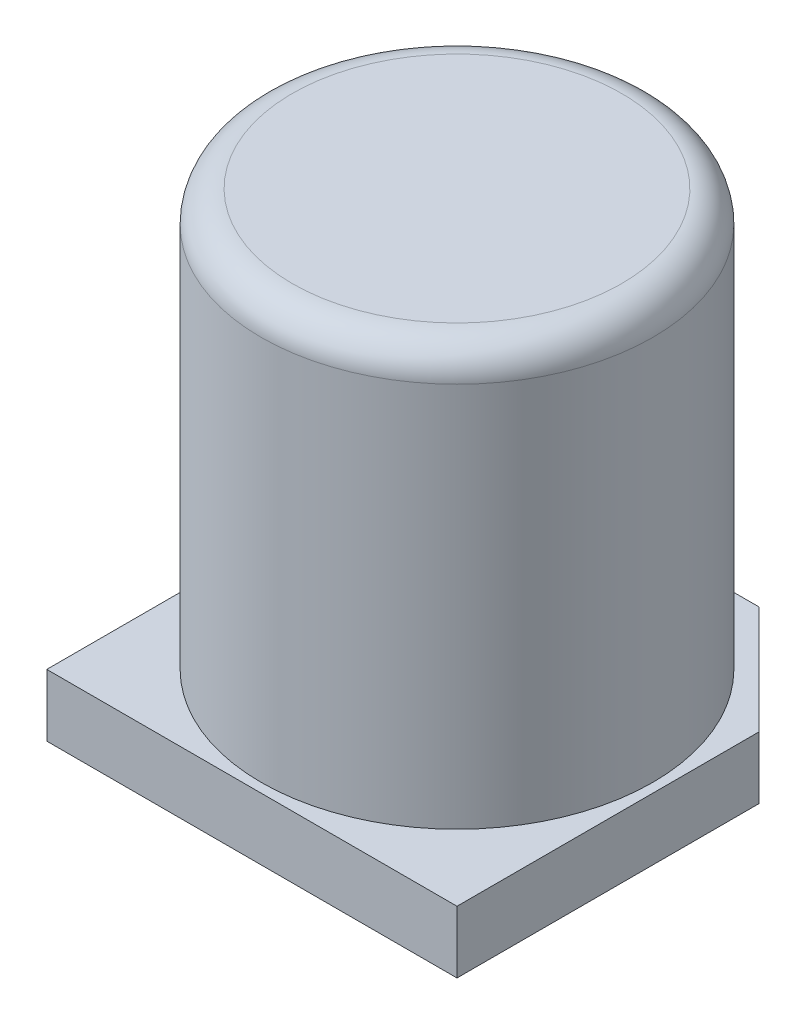
ISO-10303-21;
HEADER;
FILE_DESCRIPTION(('STEP AP214'),'2;1');
FILE_NAME('part.step','',(''),(''),'','','');
FILE_SCHEMA(('AUTOMOTIVE_DESIGN { 1 0 10303 214 1 1 1 1 }'));
ENDSEC;
DATA;
#1=APPLICATION_CONTEXT('core data for automotive mechanical design processes');
#2=APPLICATION_PROTOCOL_DEFINITION('international standard','automotive_design',2000,#1);
#3=PRODUCT_CONTEXT('',#1,'mechanical');
#4=PRODUCT('Part','Part','',(#3));
#5=PRODUCT_RELATED_PRODUCT_CATEGORY('part','',(#4));
#6=PRODUCT_DEFINITION_FORMATION('','',#4);
#7=PRODUCT_DEFINITION_CONTEXT('part definition',#1,'design');
#8=PRODUCT_DEFINITION('design','',#6,#7);
#9=PRODUCT_DEFINITION_SHAPE('','',#8);
#10=(LENGTH_UNIT() NAMED_UNIT(*) SI_UNIT(.MILLI.,.METRE.));
#11=(NAMED_UNIT(*) PLANE_ANGLE_UNIT() SI_UNIT($,.RADIAN.));
#12=(NAMED_UNIT(*) SI_UNIT($,.STERADIAN.) SOLID_ANGLE_UNIT());
#13=UNCERTAINTY_MEASURE_WITH_UNIT(LENGTH_MEASURE(1.E-05),#10,'distance_accuracy_value','');
#14=(GEOMETRIC_REPRESENTATION_CONTEXT(3) GLOBAL_UNCERTAINTY_ASSIGNED_CONTEXT((#13)) GLOBAL_UNIT_ASSIGNED_CONTEXT((#10,
#11,#12)) REPRESENTATION_CONTEXT('',''));
#15=CARTESIAN_POINT('',(0.,0.,0.));
#16=DIRECTION('',(0.,0.,1.));
#17=DIRECTION('',(1.,0.,0.));
#18=AXIS2_PLACEMENT_3D('',#15,#16,#17);
#19=CARTESIAN_POINT('',(3.3,1.,3.3));
#20=DIRECTION('',(0.,0.,1.));
#21=DIRECTION('',(1.,0.,0.));
#22=AXIS2_PLACEMENT_3D('',#19,#20,#21);
#23=PLANE('',#22);
#24=DIRECTION('',(-1.,0.,0.));
#25=VECTOR('',#24,1.);
#26=CARTESIAN_POINT('',(3.3,0.,3.3));
#27=LINE('',#26,#25);
#28=CARTESIAN_POINT('',(3.3,0.,3.3));
#29=VERTEX_POINT('',#28);
#30=CARTESIAN_POINT('',(-3.3,0.,3.3));
#31=VERTEX_POINT('',#30);
#32=EDGE_CURVE('E118',#29,#31,#27,.T.);
#33=ORIENTED_EDGE('',*,*,#32,.F.);
#34=DIRECTION('',(0.,-1.,0.));
#35=VECTOR('',#34,1.);
#36=CARTESIAN_POINT('',(3.3,1.,3.3));
#37=LINE('',#36,#35);
#38=CARTESIAN_POINT('',(3.3,1.,3.3));
#39=VERTEX_POINT('',#38);
#40=EDGE_CURVE('E98',#39,#29,#37,.T.);
#41=ORIENTED_EDGE('',*,*,#40,.F.);
#42=DIRECTION('',(-1.,0.,0.));
#43=VECTOR('',#42,1.);
#44=CARTESIAN_POINT('',(3.3,1.,3.3));
#45=LINE('',#44,#43);
#46=CARTESIAN_POINT('',(-3.3,1.,3.3));
#47=VERTEX_POINT('',#46);
#48=EDGE_CURVE('E103',#39,#47,#45,.T.);
#49=ORIENTED_EDGE('',*,*,#48,.T.);
#50=DIRECTION('',(0.,-1.,0.));
#51=VECTOR('',#50,1.);
#52=CARTESIAN_POINT('',(-3.3,1.,3.3));
#53=LINE('',#52,#51);
#54=EDGE_CURVE('E87',#47,#31,#53,.T.);
#55=ORIENTED_EDGE('',*,*,#54,.T.);
#56=EDGE_LOOP('',(#33,#41,#49,#55));
#57=FACE_BOUND('',#56,.T.);
#58=ADVANCED_FACE('F32',(#57),#23,.T.);
#59=CARTESIAN_POINT('',(3.3,1.,-3.3));
#60=DIRECTION('',(1.,0.,0.));
#61=DIRECTION('',(0.,0.,-1.));
#62=AXIS2_PLACEMENT_3D('',#59,#60,#61);
#63=PLANE('',#62);
#64=DIRECTION('',(0.,0.,1.));
#65=VECTOR('',#64,1.);
#66=CARTESIAN_POINT('',(3.3,0.,-3.3));
#67=LINE('',#66,#65);
#68=CARTESIAN_POINT('',(3.3,0.,-1.56254826892699));
#69=VERTEX_POINT('',#68);
#70=EDGE_CURVE('E108',#69,#29,#67,.T.);
#71=ORIENTED_EDGE('',*,*,#70,.F.);
#72=DIRECTION('',(0.,1.,0.));
#73=VECTOR('',#72,1.);
#74=CARTESIAN_POINT('',(3.3,1.,-1.56254826892699));
#75=LINE('',#74,#73);
#76=CARTESIAN_POINT('',(3.3,1.,-1.56254826892699));
#77=VERTEX_POINT('',#76);
#78=EDGE_CURVE('E55',#69,#77,#75,.T.);
#79=ORIENTED_EDGE('',*,*,#78,.T.);
#80=DIRECTION('',(0.,0.,1.));
#81=VECTOR('',#80,1.);
#82=CARTESIAN_POINT('',(3.3,1.,-3.3));
#83=LINE('',#82,#81);
#84=EDGE_CURVE('E99',#77,#39,#83,.T.);
#85=ORIENTED_EDGE('',*,*,#84,.T.);
#86=ORIENTED_EDGE('',*,*,#40,.T.);
#87=EDGE_LOOP('',(#71,#79,#85,#86));
#88=FACE_BOUND('',#87,.T.);
#89=ADVANCED_FACE('F154',(#88),#63,.T.);
#90=CARTESIAN_POINT('',(-3.3,1.,-3.3));
#91=DIRECTION('',(0.,0.,-1.));
#92=DIRECTION('',(-1.,0.,0.));
#93=AXIS2_PLACEMENT_3D('',#90,#91,#92);
#94=PLANE('',#93);
#95=DIRECTION('',(1.,0.,0.));
#96=VECTOR('',#95,1.);
#97=CARTESIAN_POINT('',(-3.3,1.,-3.3));
#98=LINE('',#97,#96);
#99=CARTESIAN_POINT('',(-1.56254826892699,1.,-3.3));
#100=VERTEX_POINT('',#99);
#101=CARTESIAN_POINT('',(1.56254826892701,1.,-3.3));
#102=VERTEX_POINT('',#101);
#103=EDGE_CURVE('E104',#100,#102,#98,.T.);
#104=ORIENTED_EDGE('',*,*,#103,.T.);
#105=DIRECTION('',(0.,-1.,0.));
#106=VECTOR('',#105,1.);
#107=CARTESIAN_POINT('',(1.56254826892701,1.,-3.3));
#108=LINE('',#107,#106);
#109=CARTESIAN_POINT('',(1.56254826892701,0.,-3.3));
#110=VERTEX_POINT('',#109);
#111=EDGE_CURVE('E126',#102,#110,#108,.T.);
#112=ORIENTED_EDGE('',*,*,#111,.T.);
#113=DIRECTION('',(1.,0.,0.));
#114=VECTOR('',#113,1.);
#115=CARTESIAN_POINT('',(-3.3,0.,-3.3));
#116=LINE('',#115,#114);
#117=CARTESIAN_POINT('',(-1.56254826892699,0.,-3.3));
#118=VERTEX_POINT('',#117);
#119=EDGE_CURVE('E110',#118,#110,#116,.T.);
#120=ORIENTED_EDGE('',*,*,#119,.F.);
#121=DIRECTION('',(0.,1.,0.));
#122=VECTOR('',#121,1.);
#123=CARTESIAN_POINT('',(-1.56254826892699,1.,-3.3));
#124=LINE('',#123,#122);
#125=EDGE_CURVE('E123',#118,#100,#124,.T.);
#126=ORIENTED_EDGE('',*,*,#125,.T.);
#127=EDGE_LOOP('',(#104,#112,#120,#126));
#128=FACE_BOUND('',#127,.T.);
#129=ADVANCED_FACE('F159',(#128),#94,.T.);
#130=CARTESIAN_POINT('',(-3.3,1.,3.3));
#131=DIRECTION('',(-1.,0.,0.));
#132=DIRECTION('',(0.,0.,1.));
#133=AXIS2_PLACEMENT_3D('',#130,#131,#132);
#134=PLANE('',#133);
#135=DIRECTION('',(0.,0.,-1.));
#136=VECTOR('',#135,1.);
#137=CARTESIAN_POINT('',(-3.3,1.,3.3));
#138=LINE('',#137,#136);
#139=CARTESIAN_POINT('',(-3.3,1.,-1.562548268927));
#140=VERTEX_POINT('',#139);
#141=EDGE_CURVE('E90',#47,#140,#138,.T.);
#142=ORIENTED_EDGE('',*,*,#141,.T.);
#143=DIRECTION('',(0.,-1.,0.));
#144=VECTOR('',#143,1.);
#145=CARTESIAN_POINT('',(-3.3,1.,-1.56254826892701));
#146=LINE('',#145,#144);
#147=CARTESIAN_POINT('',(-3.3,0.,-1.56254826892701));
#148=VERTEX_POINT('',#147);
#149=EDGE_CURVE('E137',#140,#148,#146,.T.);
#150=ORIENTED_EDGE('',*,*,#149,.T.);
#151=DIRECTION('',(0.,0.,-1.));
#152=VECTOR('',#151,1.);
#153=CARTESIAN_POINT('',(-3.3,0.,3.3));
#154=LINE('',#153,#152);
#155=EDGE_CURVE('E93',#31,#148,#154,.T.);
#156=ORIENTED_EDGE('',*,*,#155,.F.);
#157=ORIENTED_EDGE('',*,*,#54,.F.);
#158=EDGE_LOOP('',(#142,#150,#156,#157));
#159=FACE_BOUND('',#158,.T.);
#160=ADVANCED_FACE('F88',(#159),#134,.T.);
#161=CARTESIAN_POINT('',(0.,1.,0.));
#162=DIRECTION('',(0.,-1.,0.));
#163=DIRECTION('',(0.,0.,-1.));
#164=AXIS2_PLACEMENT_3D('',#161,#162,#163);
#165=PLANE('',#164);
#166=CARTESIAN_POINT('',(0.,1.,0.));
#167=DIRECTION('',(0.,-1.,0.));
#168=DIRECTION('',(0.,0.,-1.));
#169=AXIS2_PLACEMENT_3D('',#166,#167,#168);
#170=CIRCLE('',#169,3.15);
#171=CARTESIAN_POINT('',(0.,1.,-3.15));
#172=VERTEX_POINT('',#171);
#173=EDGE_CURVE('E113',#172,#172,#170,.T.);
#174=ORIENTED_EDGE('',*,*,#173,.T.);
#175=EDGE_LOOP('',(#174));
#176=FACE_BOUND('',#175,.T.);
#177=ORIENTED_EDGE('',*,*,#84,.F.);
#178=DIRECTION('',(0.707106781186545,0.,0.70710678118655));
#179=VECTOR('',#178,1.);
#180=CARTESIAN_POINT('',(1.56254826892701,1.,-3.3));
#181=LINE('',#180,#179);
#182=EDGE_CURVE('E135',#77,#102,#181,.F.);
#183=ORIENTED_EDGE('',*,*,#182,.T.);
#184=ORIENTED_EDGE('',*,*,#103,.F.);
#185=DIRECTION('',(0.70710678118655,0.,-0.707106781186545));
#186=VECTOR('',#185,1.);
#187=CARTESIAN_POINT('',(-3.3,1.,-1.56254826892701));
#188=LINE('',#187,#186);
#189=EDGE_CURVE('E47',#100,#140,#188,.F.);
#190=ORIENTED_EDGE('',*,*,#189,.T.);
#191=ORIENTED_EDGE('',*,*,#141,.F.);
#192=ORIENTED_EDGE('',*,*,#48,.F.);
#193=EDGE_LOOP('',(#177,#183,#184,#190,#191,#192));
#194=FACE_BOUND('',#193,.T.);
#195=ADVANCED_FACE('F102',(#176,#194),#165,.F.);
#196=CARTESIAN_POINT('',(0.,0.,0.));
#197=DIRECTION('',(0.,-1.,0.));
#198=DIRECTION('',(0.,0.,-1.));
#199=AXIS2_PLACEMENT_3D('',#196,#197,#198);
#200=PLANE('',#199);
#201=ORIENTED_EDGE('',*,*,#119,.T.);
#202=DIRECTION('',(-0.707106781186545,0.,-0.70710678118655));
#203=VECTOR('',#202,1.);
#204=CARTESIAN_POINT('',(2.43127413446351,0.,-2.43127413446349));
#205=LINE('',#204,#203);
#206=EDGE_CURVE('E131',#110,#69,#205,.F.);
#207=ORIENTED_EDGE('',*,*,#206,.T.);
#208=ORIENTED_EDGE('',*,*,#70,.T.);
#209=ORIENTED_EDGE('',*,*,#32,.T.);
#210=ORIENTED_EDGE('',*,*,#155,.T.);
#211=DIRECTION('',(-0.70710678118655,0.,0.707106781186545));
#212=VECTOR('',#211,1.);
#213=CARTESIAN_POINT('',(-2.43127413446349,0.,-2.43127413446351));
#214=LINE('',#213,#212);
#215=EDGE_CURVE('E129',#148,#118,#214,.F.);
#216=ORIENTED_EDGE('',*,*,#215,.T.);
#217=EDGE_LOOP('',(#201,#207,#208,#209,#210,#216));
#218=FACE_BOUND('',#217,.T.);
#219=ADVANCED_FACE('F178',(#218),#200,.T.);
#220=CARTESIAN_POINT('',(0.,7.7,0.));
#221=DIRECTION('',(0.,-1.,0.));
#222=DIRECTION('',(0.,0.,-1.));
#223=AXIS2_PLACEMENT_3D('',#220,#221,#222);
#224=CYLINDRICAL_SURFACE('',#223,3.15);
#225=CARTESIAN_POINT('',(0.,7.2,0.));
#226=DIRECTION('',(0.,1.,0.));
#227=DIRECTION('',(0.,0.,1.));
#228=AXIS2_PLACEMENT_3D('',#225,#226,#227);
#229=CIRCLE('',#228,3.15);
#230=CARTESIAN_POINT('',(0.,7.2,3.15));
#231=VERTEX_POINT('',#230);
#232=EDGE_CURVE('E40',#231,#231,#229,.F.);
#233=ORIENTED_EDGE('',*,*,#232,.T.);
#234=EDGE_LOOP('',(#233));
#235=FACE_BOUND('',#234,.T.);
#236=ORIENTED_EDGE('',*,*,#173,.F.);
#237=EDGE_LOOP('',(#236));
#238=FACE_BOUND('',#237,.T.);
#239=ADVANCED_FACE('F141',(#235,#238),#224,.T.);
#240=CARTESIAN_POINT('',(3.15,7.7,0.));
#241=DIRECTION('',(0.,1.,0.));
#242=DIRECTION('',(0.,0.,1.));
#243=AXIS2_PLACEMENT_3D('',#240,#241,#242);
#244=PLANE('',#243);
#245=CARTESIAN_POINT('',(0.,7.7,0.));
#246=DIRECTION('',(0.,1.,0.));
#247=DIRECTION('',(0.,0.,1.));
#248=AXIS2_PLACEMENT_3D('',#245,#246,#247);
#249=CIRCLE('',#248,2.65);
#250=CARTESIAN_POINT('',(0.,7.7,2.65));
#251=VERTEX_POINT('',#250);
#252=EDGE_CURVE('E11',#251,#251,#249,.T.);
#253=ORIENTED_EDGE('',*,*,#252,.T.);
#254=EDGE_LOOP('',(#253));
#255=FACE_BOUND('',#254,.T.);
#256=ADVANCED_FACE('F165',(#255),#244,.T.);
#257=CARTESIAN_POINT('',(1.56254826892701,1.,-3.3));
#258=DIRECTION('',(-0.70710678118655,0.,0.707106781186545));
#259=DIRECTION('',(0.,-1.,0.));
#260=AXIS2_PLACEMENT_3D('',#257,#258,#259);
#261=PLANE('',#260);
#262=ORIENTED_EDGE('',*,*,#182,.F.);
#263=ORIENTED_EDGE('',*,*,#78,.F.);
#264=ORIENTED_EDGE('',*,*,#206,.F.);
#265=ORIENTED_EDGE('',*,*,#111,.F.);
#266=EDGE_LOOP('',(#262,#263,#264,#265));
#267=FACE_BOUND('',#266,.T.);
#268=ADVANCED_FACE('F150',(#267),#261,.F.);
#269=CARTESIAN_POINT('',(-3.3,1.,-1.56254826892701));
#270=DIRECTION('',(0.707106781186545,0.,0.70710678118655));
#271=DIRECTION('',(0.,-1.,0.));
#272=AXIS2_PLACEMENT_3D('',#269,#270,#271);
#273=PLANE('',#272);
#274=ORIENTED_EDGE('',*,*,#189,.F.);
#275=ORIENTED_EDGE('',*,*,#125,.F.);
#276=ORIENTED_EDGE('',*,*,#215,.F.);
#277=ORIENTED_EDGE('',*,*,#149,.F.);
#278=EDGE_LOOP('',(#274,#275,#276,#277));
#279=FACE_BOUND('',#278,.T.);
#280=ADVANCED_FACE('F145',(#279),#273,.F.);
#281=CARTESIAN_POINT('',(0.,7.2,0.));
#282=DIRECTION('',(0.,1.,0.));
#283=DIRECTION('',(0.,0.,1.));
#284=AXIS2_PLACEMENT_3D('',#281,#282,#283);
#285=TOROIDAL_SURFACE('',#284,2.65,0.5);
#286=ORIENTED_EDGE('',*,*,#252,.F.);
#287=EDGE_LOOP('',(#286));
#288=FACE_BOUND('',#287,.T.);
#289=ORIENTED_EDGE('',*,*,#232,.F.);
#290=EDGE_LOOP('',(#289));
#291=FACE_BOUND('',#290,.T.);
#292=ADVANCED_FACE('F34',(#288,#291),#285,.T.);
#293=CLOSED_SHELL('',(#58,#89,#129,#160,#195,#219,#239,#256,#268,#280,#292));
#294=MANIFOLD_SOLID_BREP('B2',#293);
#295=ADVANCED_BREP_SHAPE_REPRESENTATION('',(#18,#294),#14);
#296=SHAPE_DEFINITION_REPRESENTATION(#9,#295);
ENDSEC;
END-ISO-10303-21;
